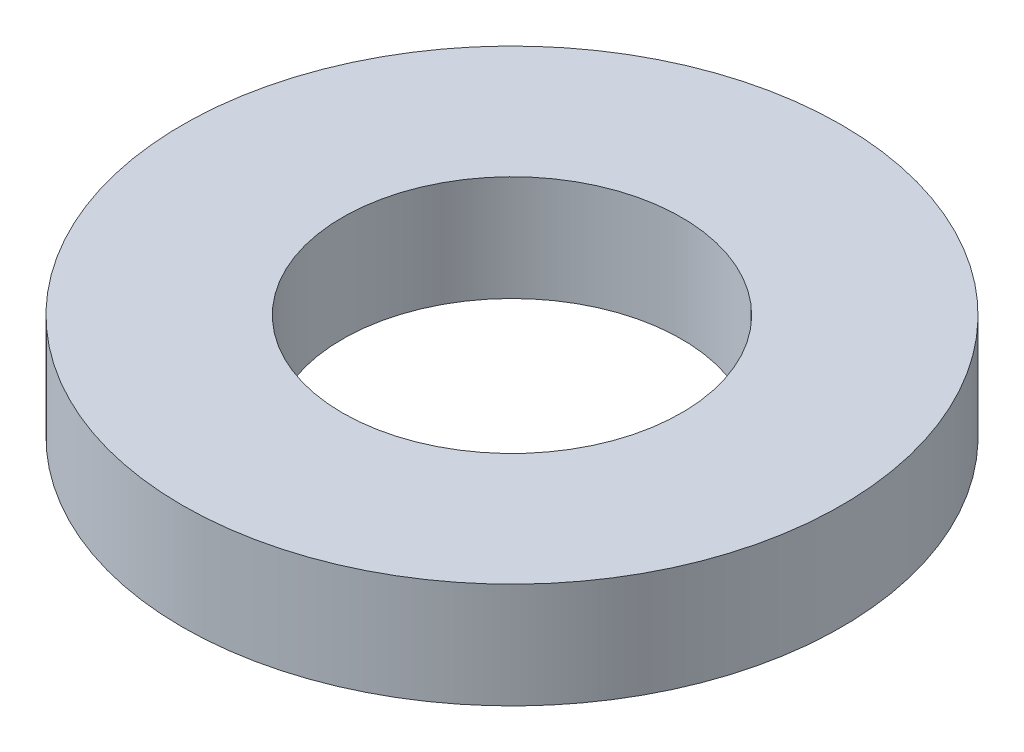
ISO-10303-21;
HEADER;
FILE_DESCRIPTION(('STEP AP214'),'2;1');
FILE_NAME('part.step','',(''),(''),'','','');
FILE_SCHEMA(('AUTOMOTIVE_DESIGN { 1 0 10303 214 1 1 1 1 }'));
ENDSEC;
DATA;
#1=APPLICATION_CONTEXT('core data for automotive mechanical design processes');
#2=APPLICATION_PROTOCOL_DEFINITION('international standard','automotive_design',2000,#1);
#3=PRODUCT_CONTEXT('',#1,'mechanical');
#4=PRODUCT('Part','Part','',(#3));
#5=PRODUCT_RELATED_PRODUCT_CATEGORY('part','',(#4));
#6=PRODUCT_DEFINITION_FORMATION('','',#4);
#7=PRODUCT_DEFINITION_CONTEXT('part definition',#1,'design');
#8=PRODUCT_DEFINITION('design','',#6,#7);
#9=PRODUCT_DEFINITION_SHAPE('','',#8);
#10=(LENGTH_UNIT() NAMED_UNIT(*) SI_UNIT(.MILLI.,.METRE.));
#11=(NAMED_UNIT(*) PLANE_ANGLE_UNIT() SI_UNIT($,.RADIAN.));
#12=(NAMED_UNIT(*) SI_UNIT($,.STERADIAN.) SOLID_ANGLE_UNIT());
#13=UNCERTAINTY_MEASURE_WITH_UNIT(LENGTH_MEASURE(1.E-05),#10,'distance_accuracy_value','');
#14=(GEOMETRIC_REPRESENTATION_CONTEXT(3) GLOBAL_UNCERTAINTY_ASSIGNED_CONTEXT((#13)) GLOBAL_UNIT_ASSIGNED_CONTEXT((#10,
#11,#12)) REPRESENTATION_CONTEXT('',''));
#15=CARTESIAN_POINT('',(0.,0.,0.));
#16=DIRECTION('',(0.,0.,1.));
#17=DIRECTION('',(1.,0.,0.));
#18=AXIS2_PLACEMENT_3D('',#15,#16,#17);
#19=CARTESIAN_POINT('',(0.,28.,0.));
#20=DIRECTION('',(0.,-1.,0.));
#21=DIRECTION('',(0.,0.,-1.));
#22=AXIS2_PLACEMENT_3D('',#19,#20,#21);
#23=CYLINDRICAL_SURFACE('',#22,87.5);
#24=CARTESIAN_POINT('',(0.,28.,0.));
#25=DIRECTION('',(0.,1.,0.));
#26=DIRECTION('',(0.,0.,1.));
#27=AXIS2_PLACEMENT_3D('',#24,#25,#26);
#28=CIRCLE('',#27,87.5);
#29=CARTESIAN_POINT('',(0.,28.,87.5));
#30=VERTEX_POINT('',#29);
#31=EDGE_CURVE('E10',#30,#30,#28,.T.);
#32=ORIENTED_EDGE('',*,*,#31,.F.);
#33=EDGE_LOOP('',(#32));
#34=FACE_BOUND('',#33,.T.);
#35=CARTESIAN_POINT('',(0.,0.,0.));
#36=DIRECTION('',(0.,1.,0.));
#37=DIRECTION('',(0.,0.,1.));
#38=AXIS2_PLACEMENT_3D('',#35,#36,#37);
#39=CIRCLE('',#38,87.5);
#40=CARTESIAN_POINT('',(0.,0.,87.5));
#41=VERTEX_POINT('',#40);
#42=EDGE_CURVE('E37',#41,#41,#39,.T.);
#43=ORIENTED_EDGE('',*,*,#42,.T.);
#44=EDGE_LOOP('',(#43));
#45=FACE_BOUND('',#44,.T.);
#46=ADVANCED_FACE('F40',(#34,#45),#23,.T.);
#47=CARTESIAN_POINT('',(0.,28.,0.));
#48=DIRECTION('',(0.,1.,0.));
#49=DIRECTION('',(0.,0.,1.));
#50=AXIS2_PLACEMENT_3D('',#47,#48,#49);
#51=PLANE('',#50);
#52=CARTESIAN_POINT('',(0.,28.,0.));
#53=DIRECTION('',(0.,1.,0.));
#54=DIRECTION('',(0.,0.,1.));
#55=AXIS2_PLACEMENT_3D('',#52,#53,#54);
#56=CIRCLE('',#55,45.);
#57=CARTESIAN_POINT('',(0.,28.,45.));
#58=VERTEX_POINT('',#57);
#59=EDGE_CURVE('E50',#58,#58,#56,.T.);
#60=ORIENTED_EDGE('',*,*,#59,.F.);
#61=EDGE_LOOP('',(#60));
#62=FACE_BOUND('',#61,.T.);
#63=ORIENTED_EDGE('',*,*,#31,.T.);
#64=EDGE_LOOP('',(#63));
#65=FACE_BOUND('',#64,.T.);
#66=ADVANCED_FACE('F59',(#62,#65),#51,.T.);
#67=CARTESIAN_POINT('',(0.,0.,0.));
#68=DIRECTION('',(0.,1.,0.));
#69=DIRECTION('',(0.,0.,1.));
#70=AXIS2_PLACEMENT_3D('',#67,#68,#69);
#71=PLANE('',#70);
#72=CARTESIAN_POINT('',(0.,0.,0.));
#73=DIRECTION('',(0.,1.,0.));
#74=DIRECTION('',(0.,0.,1.));
#75=AXIS2_PLACEMENT_3D('',#72,#73,#74);
#76=CIRCLE('',#75,45.);
#77=CARTESIAN_POINT('',(0.,0.,45.));
#78=VERTEX_POINT('',#77);
#79=EDGE_CURVE('E47',#78,#78,#76,.T.);
#80=ORIENTED_EDGE('',*,*,#79,.T.);
#81=EDGE_LOOP('',(#80));
#82=FACE_BOUND('',#81,.T.);
#83=ORIENTED_EDGE('',*,*,#42,.F.);
#84=EDGE_LOOP('',(#83));
#85=FACE_BOUND('',#84,.T.);
#86=ADVANCED_FACE('F58',(#82,#85),#71,.F.);
#87=CARTESIAN_POINT('',(0.,28.,0.));
#88=DIRECTION('',(0.,-1.,0.));
#89=DIRECTION('',(0.,0.,-1.));
#90=AXIS2_PLACEMENT_3D('',#87,#88,#89);
#91=CYLINDRICAL_SURFACE('',#90,45.);
#92=ORIENTED_EDGE('',*,*,#59,.T.);
#93=EDGE_LOOP('',(#92));
#94=FACE_BOUND('',#93,.T.);
#95=ORIENTED_EDGE('',*,*,#79,.F.);
#96=EDGE_LOOP('',(#95));
#97=FACE_BOUND('',#96,.T.);
#98=ADVANCED_FACE('F54',(#94,#97),#91,.F.);
#99=CLOSED_SHELL('',(#46,#66,#86,#98));
#100=MANIFOLD_SOLID_BREP('B2',#99);
#101=ADVANCED_BREP_SHAPE_REPRESENTATION('',(#18,#100),#14);
#102=SHAPE_DEFINITION_REPRESENTATION(#9,#101);
ENDSEC;
END-ISO-10303-21;
